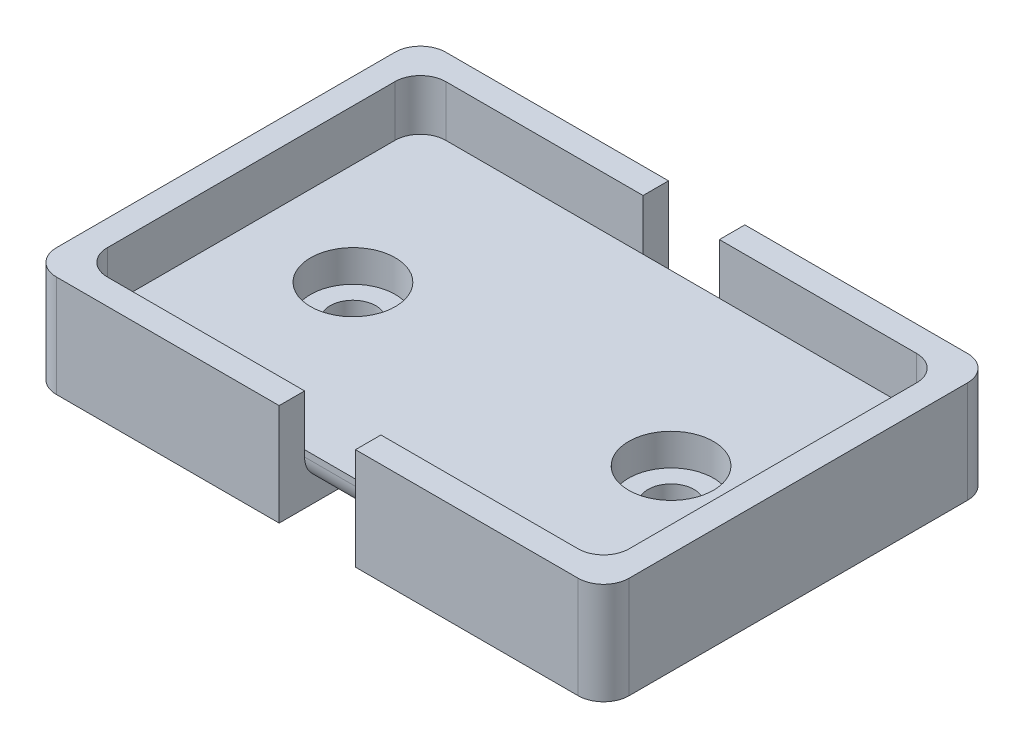
ISO-10303-21;
HEADER;
FILE_DESCRIPTION(('STEP AP214'),'2;1');
FILE_NAME('part.step','',(''),(''),'','','');
FILE_SCHEMA(('AUTOMOTIVE_DESIGN { 1 0 10303 214 1 1 1 1 }'));
ENDSEC;
DATA;
#1=APPLICATION_CONTEXT('core data for automotive mechanical design processes');
#2=APPLICATION_PROTOCOL_DEFINITION('international standard','automotive_design',2000,#1);
#3=PRODUCT_CONTEXT('',#1,'mechanical');
#4=PRODUCT('Part','Part','',(#3));
#5=PRODUCT_RELATED_PRODUCT_CATEGORY('part','',(#4));
#6=PRODUCT_DEFINITION_FORMATION('','',#4);
#7=PRODUCT_DEFINITION_CONTEXT('part definition',#1,'design');
#8=PRODUCT_DEFINITION('design','',#6,#7);
#9=PRODUCT_DEFINITION_SHAPE('','',#8);
#10=(LENGTH_UNIT() NAMED_UNIT(*) SI_UNIT(.MILLI.,.METRE.));
#11=(NAMED_UNIT(*) PLANE_ANGLE_UNIT() SI_UNIT($,.RADIAN.));
#12=(NAMED_UNIT(*) SI_UNIT($,.STERADIAN.) SOLID_ANGLE_UNIT());
#13=UNCERTAINTY_MEASURE_WITH_UNIT(LENGTH_MEASURE(1.E-05),#10,'distance_accuracy_value','');
#14=(GEOMETRIC_REPRESENTATION_CONTEXT(3) GLOBAL_UNCERTAINTY_ASSIGNED_CONTEXT((#13)) GLOBAL_UNIT_ASSIGNED_CONTEXT((#10,
#11,#12)) REPRESENTATION_CONTEXT('',''));
#15=CARTESIAN_POINT('',(0.,0.,0.));
#16=DIRECTION('',(0.,0.,1.));
#17=DIRECTION('',(1.,0.,0.));
#18=AXIS2_PLACEMENT_3D('',#15,#16,#17);
#19=CARTESIAN_POINT('',(0.,5.08,0.));
#20=DIRECTION('',(0.,1.,0.));
#21=DIRECTION('',(0.,0.,1.));
#22=AXIS2_PLACEMENT_3D('',#19,#20,#21);
#23=PLANE('',#22);
#24=CARTESIAN_POINT('',(41.91,5.08,-16.891));
#25=DIRECTION('',(0.,1.,0.));
#26=DIRECTION('',(0.,0.,1.));
#27=AXIS2_PLACEMENT_3D('',#24,#25,#26);
#28=CIRCLE('',#27,4.2291);
#29=CARTESIAN_POINT('',(41.91,5.08,-12.6619));
#30=VERTEX_POINT('',#29);
#31=EDGE_CURVE('E335',#30,#30,#28,.T.);
#32=ORIENTED_EDGE('',*,*,#31,.F.);
#33=EDGE_LOOP('',(#32));
#34=FACE_BOUND('',#33,.T.);
#35=CARTESIAN_POINT('',(10.16,5.08,-16.891));
#36=DIRECTION('',(0.,1.,0.));
#37=DIRECTION('',(0.,0.,1.));
#38=AXIS2_PLACEMENT_3D('',#35,#36,#37);
#39=CIRCLE('',#38,4.2291);
#40=CARTESIAN_POINT('',(10.16,5.08,-12.6619));
#41=VERTEX_POINT('',#40);
#42=EDGE_CURVE('E332',#41,#41,#39,.T.);
#43=ORIENTED_EDGE('',*,*,#42,.F.);
#44=EDGE_LOOP('',(#43));
#45=FACE_BOUND('',#44,.T.);
#46=DIRECTION('',(0.,0.,-1.));
#47=VECTOR('',#46,1.);
#48=CARTESIAN_POINT('',(0.,5.08,0.));
#49=LINE('',#48,#47);
#50=CARTESIAN_POINT('',(0.,5.08,-2.54));
#51=VERTEX_POINT('',#50);
#52=CARTESIAN_POINT('',(0.,5.08,-31.242));
#53=VERTEX_POINT('',#52);
#54=EDGE_CURVE('E301',#51,#53,#49,.T.);
#55=ORIENTED_EDGE('',*,*,#54,.F.);
#56=CARTESIAN_POINT('',(2.54,5.08,-2.54));
#57=DIRECTION('',(0.,1.,0.));
#58=DIRECTION('',(0.,0.,1.));
#59=AXIS2_PLACEMENT_3D('',#56,#57,#58);
#60=CIRCLE('',#59,2.54);
#61=CARTESIAN_POINT('',(2.54,5.08,0.));
#62=VERTEX_POINT('',#61);
#63=EDGE_CURVE('E424',#51,#62,#60,.T.);
#64=ORIENTED_EDGE('',*,*,#63,.T.);
#65=DIRECTION('',(1.,0.,0.));
#66=VECTOR('',#65,1.);
#67=CARTESIAN_POINT('',(0.,5.08,0.));
#68=LINE('',#67,#66);
#69=CARTESIAN_POINT('',(22.225,5.08,0.));
#70=VERTEX_POINT('',#69);
#71=EDGE_CURVE('E279',#62,#70,#68,.T.);
#72=ORIENTED_EDGE('',*,*,#71,.T.);
#73=DIRECTION('',(1.,0.,0.));
#74=VECTOR('',#73,1.);
#75=CARTESIAN_POINT('',(0.,5.08,0.));
#76=LINE('',#75,#74);
#77=CARTESIAN_POINT('',(29.845,5.08,0.));
#78=VERTEX_POINT('',#77);
#79=EDGE_CURVE('E326',#70,#78,#76,.T.);
#80=ORIENTED_EDGE('',*,*,#79,.T.);
#81=DIRECTION('',(1.,0.,0.));
#82=VECTOR('',#81,1.);
#83=CARTESIAN_POINT('',(0.,5.08,0.));
#84=LINE('',#83,#82);
#85=CARTESIAN_POINT('',(49.53,5.08,0.));
#86=VERTEX_POINT('',#85);
#87=EDGE_CURVE('E252',#78,#86,#84,.T.);
#88=ORIENTED_EDGE('',*,*,#87,.T.);
#89=CARTESIAN_POINT('',(49.53,5.08,-2.54));
#90=DIRECTION('',(0.,1.,0.));
#91=DIRECTION('',(0.,0.,1.));
#92=AXIS2_PLACEMENT_3D('',#89,#90,#91);
#93=CIRCLE('',#92,2.54);
#94=CARTESIAN_POINT('',(52.07,5.08,-2.54));
#95=VERTEX_POINT('',#94);
#96=EDGE_CURVE('E422',#86,#95,#93,.T.);
#97=ORIENTED_EDGE('',*,*,#96,.T.);
#98=DIRECTION('',(0.,0.,-1.));
#99=VECTOR('',#98,1.);
#100=CARTESIAN_POINT('',(52.07,5.08,0.));
#101=LINE('',#100,#99);
#102=CARTESIAN_POINT('',(52.07,5.08,-31.242));
#103=VERTEX_POINT('',#102);
#104=EDGE_CURVE('E255',#95,#103,#101,.T.);
#105=ORIENTED_EDGE('',*,*,#104,.T.);
#106=CARTESIAN_POINT('',(49.53,5.08,-31.242));
#107=DIRECTION('',(0.,1.,0.));
#108=DIRECTION('',(0.,0.,1.));
#109=AXIS2_PLACEMENT_3D('',#106,#107,#108);
#110=CIRCLE('',#109,2.54);
#111=CARTESIAN_POINT('',(49.53,5.08,-33.782));
#112=VERTEX_POINT('',#111);
#113=EDGE_CURVE('E420',#103,#112,#110,.T.);
#114=ORIENTED_EDGE('',*,*,#113,.T.);
#115=DIRECTION('',(1.,0.,0.));
#116=VECTOR('',#115,1.);
#117=CARTESIAN_POINT('',(0.,5.08,-33.782));
#118=LINE('',#117,#116);
#119=CARTESIAN_POINT('',(29.845,5.08,-33.782));
#120=VERTEX_POINT('',#119);
#121=EDGE_CURVE('E271',#120,#112,#118,.T.);
#122=ORIENTED_EDGE('',*,*,#121,.F.);
#123=DIRECTION('',(1.,0.,0.));
#124=VECTOR('',#123,1.);
#125=CARTESIAN_POINT('',(0.,5.08,-33.782));
#126=LINE('',#125,#124);
#127=CARTESIAN_POINT('',(22.225,5.08,-33.782));
#128=VERTEX_POINT('',#127);
#129=EDGE_CURVE('E328',#128,#120,#126,.T.);
#130=ORIENTED_EDGE('',*,*,#129,.F.);
#131=DIRECTION('',(1.,0.,0.));
#132=VECTOR('',#131,1.);
#133=CARTESIAN_POINT('',(0.,5.08,-33.782));
#134=LINE('',#133,#132);
#135=CARTESIAN_POINT('',(2.54,5.08,-33.782));
#136=VERTEX_POINT('',#135);
#137=EDGE_CURVE('E284',#136,#128,#134,.T.);
#138=ORIENTED_EDGE('',*,*,#137,.F.);
#139=CARTESIAN_POINT('',(2.54,5.08,-31.242));
#140=DIRECTION('',(0.,1.,0.));
#141=DIRECTION('',(0.,0.,1.));
#142=AXIS2_PLACEMENT_3D('',#139,#140,#141);
#143=CIRCLE('',#142,2.54);
#144=EDGE_CURVE('E418',#136,#53,#143,.T.);
#145=ORIENTED_EDGE('',*,*,#144,.T.);
#146=EDGE_LOOP('',(#55,#64,#72,#80,#88,#97,#105,#114,#122,#130,#138,#145));
#147=FACE_BOUND('',#146,.T.);
#148=ADVANCED_FACE('F35',(#34,#45,#147),#23,.T.);
#149=CARTESIAN_POINT('',(0.,1.905,0.));
#150=DIRECTION('',(0.,1.,0.));
#151=DIRECTION('',(0.,0.,1.));
#152=AXIS2_PLACEMENT_3D('',#149,#150,#151);
#153=PLANE('',#152);
#154=DIRECTION('',(0.,0.,1.));
#155=VECTOR('',#154,1.);
#156=CARTESIAN_POINT('',(22.225,1.905,0.));
#157=LINE('',#156,#155);
#158=CARTESIAN_POINT('',(22.225,1.905,-31.242));
#159=VERTEX_POINT('',#158);
#160=CARTESIAN_POINT('',(22.225,1.905,-2.54));
#161=VERTEX_POINT('',#160);
#162=EDGE_CURVE('E354',#159,#161,#157,.T.);
#163=ORIENTED_EDGE('',*,*,#162,.F.);
#164=DIRECTION('',(1.,0.,0.));
#165=VECTOR('',#164,1.);
#166=CARTESIAN_POINT('',(29.845,1.905,-31.242));
#167=LINE('',#166,#165);
#168=CARTESIAN_POINT('',(29.845,1.905,-31.242));
#169=VERTEX_POINT('',#168);
#170=EDGE_CURVE('E362',#159,#169,#167,.T.);
#171=ORIENTED_EDGE('',*,*,#170,.T.);
#172=DIRECTION('',(0.,0.,-1.));
#173=VECTOR('',#172,1.);
#174=CARTESIAN_POINT('',(29.845,1.905,0.));
#175=LINE('',#174,#173);
#176=CARTESIAN_POINT('',(29.845,1.905,-2.54));
#177=VERTEX_POINT('',#176);
#178=EDGE_CURVE('E374',#177,#169,#175,.T.);
#179=ORIENTED_EDGE('',*,*,#178,.F.);
#180=DIRECTION('',(1.,0.,0.));
#181=VECTOR('',#180,1.);
#182=CARTESIAN_POINT('',(0.,1.905,-2.54));
#183=LINE('',#182,#181);
#184=EDGE_CURVE('E360',#177,#161,#183,.F.);
#185=ORIENTED_EDGE('',*,*,#184,.T.);
#186=EDGE_LOOP('',(#163,#171,#179,#185));
#187=FACE_BOUND('',#186,.T.);
#188=ADVANCED_FACE('F378',(#187),#153,.F.);
#189=CARTESIAN_POINT('',(0.,1.905,0.));
#190=DIRECTION('',(0.,1.,0.));
#191=DIRECTION('',(0.,0.,1.));
#192=AXIS2_PLACEMENT_3D('',#189,#190,#191);
#193=PLANE('',#192);
#194=CARTESIAN_POINT('',(10.16,1.905,-16.891));
#195=DIRECTION('',(0.,1.,0.));
#196=DIRECTION('',(0.,0.,1.));
#197=AXIS2_PLACEMENT_3D('',#194,#195,#196);
#198=CIRCLE('',#197,2.286);
#199=CARTESIAN_POINT('',(10.16,1.905,-14.605));
#200=VERTEX_POINT('',#199);
#201=EDGE_CURVE('E351',#200,#200,#198,.T.);
#202=ORIENTED_EDGE('',*,*,#201,.F.);
#203=EDGE_LOOP('',(#202));
#204=FACE_BOUND('',#203,.T.);
#205=CARTESIAN_POINT('',(10.16,1.905,-16.891));
#206=DIRECTION('',(0.,1.,0.));
#207=DIRECTION('',(0.,0.,1.));
#208=AXIS2_PLACEMENT_3D('',#205,#206,#207);
#209=CIRCLE('',#208,4.2291);
#210=CARTESIAN_POINT('',(10.16,1.905,-12.6619));
#211=VERTEX_POINT('',#210);
#212=EDGE_CURVE('E313',#211,#211,#209,.T.);
#213=ORIENTED_EDGE('',*,*,#212,.T.);
#214=EDGE_LOOP('',(#213));
#215=FACE_BOUND('',#214,.T.);
#216=ADVANCED_FACE('F554',(#204,#215),#193,.T.);
#217=CARTESIAN_POINT('',(0.,1.905,2.54));
#218=DIRECTION('',(0.,0.,-1.));
#219=DIRECTION('',(-1.,0.,0.));
#220=AXIS2_PLACEMENT_3D('',#217,#218,#219);
#221=PLANE('',#220);
#222=DIRECTION('',(1.,0.,0.));
#223=VECTOR('',#222,1.);
#224=CARTESIAN_POINT('',(0.,10.16,2.54));
#225=LINE('',#224,#223);
#226=CARTESIAN_POINT('',(0.,10.16,2.54));
#227=VERTEX_POINT('',#226);
#228=CARTESIAN_POINT('',(22.225,10.16,2.54));
#229=VERTEX_POINT('',#228);
#230=EDGE_CURVE('E290',#227,#229,#225,.T.);
#231=ORIENTED_EDGE('',*,*,#230,.F.);
#232=DIRECTION('',(0.,-1.,0.));
#233=VECTOR('',#232,1.);
#234=CARTESIAN_POINT('',(0.,0.,2.54));
#235=LINE('',#234,#233);
#236=CARTESIAN_POINT('',(0.,0.,2.54));
#237=VERTEX_POINT('',#236);
#238=EDGE_CURVE('E428',#227,#237,#235,.T.);
#239=ORIENTED_EDGE('',*,*,#238,.T.);
#240=DIRECTION('',(1.,0.,0.));
#241=VECTOR('',#240,1.);
#242=CARTESIAN_POINT('',(0.,0.,2.54));
#243=LINE('',#242,#241);
#244=CARTESIAN_POINT('',(22.225,0.,2.54));
#245=VERTEX_POINT('',#244);
#246=EDGE_CURVE('E387',#237,#245,#243,.T.);
#247=ORIENTED_EDGE('',*,*,#246,.T.);
#248=DIRECTION('',(0.,-1.,0.));
#249=VECTOR('',#248,1.);
#250=CARTESIAN_POINT('',(22.225,1.905,2.54));
#251=LINE('',#250,#249);
#252=EDGE_CURVE('E381',#229,#245,#251,.T.);
#253=ORIENTED_EDGE('',*,*,#252,.F.);
#254=EDGE_LOOP('',(#231,#239,#247,#253));
#255=FACE_BOUND('',#254,.T.);
#256=ADVANCED_FACE('F506',(#255),#221,.F.);
#257=CARTESIAN_POINT('',(22.225,1.905,0.));
#258=DIRECTION('',(1.,0.,0.));
#259=DIRECTION('',(0.,0.,-1.));
#260=AXIS2_PLACEMENT_3D('',#257,#258,#259);
#261=PLANE('',#260);
#262=DIRECTION('',(0.,0.,1.));
#263=VECTOR('',#262,1.);
#264=CARTESIAN_POINT('',(22.225,0.,0.));
#265=LINE('',#264,#263);
#266=CARTESIAN_POINT('',(22.225,0.,-36.322));
#267=VERTEX_POINT('',#266);
#268=EDGE_CURVE('E389',#267,#245,#265,.T.);
#269=ORIENTED_EDGE('',*,*,#268,.F.);
#270=DIRECTION('',(0.,-1.,0.));
#271=VECTOR('',#270,1.);
#272=CARTESIAN_POINT('',(22.225,1.905,-36.322));
#273=LINE('',#272,#271);
#274=CARTESIAN_POINT('',(22.225,10.16,-36.322));
#275=VERTEX_POINT('',#274);
#276=EDGE_CURVE('E509',#275,#267,#273,.T.);
#277=ORIENTED_EDGE('',*,*,#276,.F.);
#278=DIRECTION('',(0.,0.,1.));
#279=VECTOR('',#278,1.);
#280=CARTESIAN_POINT('',(22.225,10.16,0.));
#281=LINE('',#280,#279);
#282=CARTESIAN_POINT('',(22.225,10.16,-33.782));
#283=VERTEX_POINT('',#282);
#284=EDGE_CURVE('E280',#275,#283,#281,.T.);
#285=ORIENTED_EDGE('',*,*,#284,.T.);
#286=DIRECTION('',(0.,-1.,0.));
#287=VECTOR('',#286,1.);
#288=CARTESIAN_POINT('',(22.225,10.16,-33.782));
#289=LINE('',#288,#287);
#290=EDGE_CURVE('E299',#283,#128,#289,.T.);
#291=ORIENTED_EDGE('',*,*,#290,.T.);
#292=DIRECTION('',(0.,-1.,0.));
#293=VECTOR('',#292,1.);
#294=CARTESIAN_POINT('',(22.225,5.08,-33.782));
#295=LINE('',#294,#293);
#296=CARTESIAN_POINT('',(22.225,4.445,-33.782));
#297=VERTEX_POINT('',#296);
#298=EDGE_CURVE('E338',#128,#297,#295,.T.);
#299=ORIENTED_EDGE('',*,*,#298,.T.);
#300=CARTESIAN_POINT('',(22.225,4.445,-31.242));
#301=DIRECTION('',(1.,0.,0.));
#302=DIRECTION('',(0.,0.,-1.));
#303=AXIS2_PLACEMENT_3D('',#300,#301,#302);
#304=CIRCLE('',#303,2.54);
#305=EDGE_CURVE('E371',#297,#159,#304,.F.);
#306=ORIENTED_EDGE('',*,*,#305,.T.);
#307=ORIENTED_EDGE('',*,*,#162,.T.);
#308=CARTESIAN_POINT('',(22.225,4.445,-2.54));
#309=DIRECTION('',(1.,0.,0.));
#310=DIRECTION('',(0.,0.,-1.));
#311=AXIS2_PLACEMENT_3D('',#308,#309,#310);
#312=CIRCLE('',#311,2.54);
#313=CARTESIAN_POINT('',(22.225,4.445,0.));
#314=VERTEX_POINT('',#313);
#315=EDGE_CURVE('E11',#161,#314,#312,.F.);
#316=ORIENTED_EDGE('',*,*,#315,.T.);
#317=DIRECTION('',(0.,-1.,0.));
#318=VECTOR('',#317,1.);
#319=CARTESIAN_POINT('',(22.225,5.08,0.));
#320=LINE('',#319,#318);
#321=EDGE_CURVE('E348',#70,#314,#320,.T.);
#322=ORIENTED_EDGE('',*,*,#321,.F.);
#323=DIRECTION('',(0.,-1.,0.));
#324=VECTOR('',#323,1.);
#325=CARTESIAN_POINT('',(22.225,10.16,0.));
#326=LINE('',#325,#324);
#327=CARTESIAN_POINT('',(22.225,10.16,0.));
#328=VERTEX_POINT('',#327);
#329=EDGE_CURVE('E307',#328,#70,#326,.T.);
#330=ORIENTED_EDGE('',*,*,#329,.F.);
#331=EDGE_CURVE('E285',#328,#229,#281,.T.);
#332=ORIENTED_EDGE('',*,*,#331,.T.);
#333=ORIENTED_EDGE('',*,*,#252,.T.);
#334=EDGE_LOOP('',(#269,#277,#285,#291,#299,#306,#307,#316,#322,#330,#332,#333));
#335=FACE_BOUND('',#334,.T.);
#336=ADVANCED_FACE('F498',(#335),#261,.T.);
#337=CARTESIAN_POINT('',(0.,1.905,-36.322));
#338=DIRECTION('',(0.,0.,-1.));
#339=DIRECTION('',(-1.,0.,0.));
#340=AXIS2_PLACEMENT_3D('',#337,#338,#339);
#341=PLANE('',#340);
#342=DIRECTION('',(1.,0.,0.));
#343=VECTOR('',#342,1.);
#344=CARTESIAN_POINT('',(0.,0.,-36.322));
#345=LINE('',#344,#343);
#346=CARTESIAN_POINT('',(0.,0.,-36.322));
#347=VERTEX_POINT('',#346);
#348=EDGE_CURVE('E521',#347,#267,#345,.T.);
#349=ORIENTED_EDGE('',*,*,#348,.F.);
#350=DIRECTION('',(0.,-1.,0.));
#351=VECTOR('',#350,1.);
#352=CARTESIAN_POINT('',(0.,1.905,-36.322));
#353=LINE('',#352,#351);
#354=CARTESIAN_POINT('',(0.,10.16,-36.322));
#355=VERTEX_POINT('',#354);
#356=EDGE_CURVE('E407',#347,#355,#353,.F.);
#357=ORIENTED_EDGE('',*,*,#356,.T.);
#358=DIRECTION('',(1.,0.,0.));
#359=VECTOR('',#358,1.);
#360=CARTESIAN_POINT('',(0.,10.16,-36.322));
#361=LINE('',#360,#359);
#362=EDGE_CURVE('E283',#355,#275,#361,.T.);
#363=ORIENTED_EDGE('',*,*,#362,.T.);
#364=ORIENTED_EDGE('',*,*,#276,.T.);
#365=EDGE_LOOP('',(#349,#357,#363,#364));
#366=FACE_BOUND('',#365,.T.);
#367=ADVANCED_FACE('F599',(#366),#341,.T.);
#368=CARTESIAN_POINT('',(-2.54,1.905,0.));
#369=DIRECTION('',(-1.,0.,0.));
#370=DIRECTION('',(0.,0.,1.));
#371=AXIS2_PLACEMENT_3D('',#368,#369,#370);
#372=PLANE('',#371);
#373=DIRECTION('',(0.,0.,-1.));
#374=VECTOR('',#373,1.);
#375=CARTESIAN_POINT('',(-2.54,10.16,0.));
#376=LINE('',#375,#374);
#377=CARTESIAN_POINT('',(-2.54,10.16,0.));
#378=VERTEX_POINT('',#377);
#379=CARTESIAN_POINT('',(-2.54,10.16,-33.782));
#380=VERTEX_POINT('',#379);
#381=EDGE_CURVE('E287',#378,#380,#376,.T.);
#382=ORIENTED_EDGE('',*,*,#381,.T.);
#383=DIRECTION('',(0.,-1.,0.));
#384=VECTOR('',#383,1.);
#385=CARTESIAN_POINT('',(-2.54,1.905,-33.782));
#386=LINE('',#385,#384);
#387=CARTESIAN_POINT('',(-2.54,0.,-33.782));
#388=VERTEX_POINT('',#387);
#389=EDGE_CURVE('E400',#380,#388,#386,.T.);
#390=ORIENTED_EDGE('',*,*,#389,.T.);
#391=DIRECTION('',(0.,0.,-1.));
#392=VECTOR('',#391,1.);
#393=CARTESIAN_POINT('',(-2.54,0.,0.));
#394=LINE('',#393,#392);
#395=CARTESIAN_POINT('',(-2.54,0.,0.));
#396=VERTEX_POINT('',#395);
#397=EDGE_CURVE('E518',#396,#388,#394,.T.);
#398=ORIENTED_EDGE('',*,*,#397,.F.);
#399=DIRECTION('',(0.,-1.,0.));
#400=VECTOR('',#399,1.);
#401=CARTESIAN_POINT('',(-2.54,10.16,0.));
#402=LINE('',#401,#400);
#403=EDGE_CURVE('E380',#396,#378,#402,.F.);
#404=ORIENTED_EDGE('',*,*,#403,.T.);
#405=EDGE_LOOP('',(#382,#390,#398,#404));
#406=FACE_BOUND('',#405,.T.);
#407=ADVANCED_FACE('F533',(#406),#372,.T.);
#408=CARTESIAN_POINT('',(10.16,1.905,-16.891));
#409=DIRECTION('',(0.,-1.,0.));
#410=DIRECTION('',(0.,0.,-1.));
#411=AXIS2_PLACEMENT_3D('',#408,#409,#410);
#412=CYLINDRICAL_SURFACE('',#411,2.286);
#413=ORIENTED_EDGE('',*,*,#201,.T.);
#414=EDGE_LOOP('',(#413));
#415=FACE_BOUND('',#414,.T.);
#416=CARTESIAN_POINT('',(10.16,0.,-16.891));
#417=DIRECTION('',(0.,1.,0.));
#418=DIRECTION('',(0.,0.,1.));
#419=AXIS2_PLACEMENT_3D('',#416,#417,#418);
#420=CIRCLE('',#419,2.286);
#421=CARTESIAN_POINT('',(10.16,0.,-14.605));
#422=VERTEX_POINT('',#421);
#423=EDGE_CURVE('E357',#422,#422,#420,.T.);
#424=ORIENTED_EDGE('',*,*,#423,.F.);
#425=EDGE_LOOP('',(#424));
#426=FACE_BOUND('',#425,.T.);
#427=ADVANCED_FACE('F593',(#415,#426),#412,.F.);
#428=CARTESIAN_POINT('',(0.,0.,0.));
#429=DIRECTION('',(0.,1.,0.));
#430=DIRECTION('',(0.,0.,1.));
#431=AXIS2_PLACEMENT_3D('',#428,#429,#430);
#432=PLANE('',#431);
#433=ORIENTED_EDGE('',*,*,#397,.T.);
#434=CARTESIAN_POINT('',(0.,0.,-33.782));
#435=DIRECTION('',(0.,1.,0.));
#436=DIRECTION('',(0.,0.,1.));
#437=AXIS2_PLACEMENT_3D('',#434,#435,#436);
#438=CIRCLE('',#437,2.54);
#439=EDGE_CURVE('E405',#388,#347,#438,.F.);
#440=ORIENTED_EDGE('',*,*,#439,.T.);
#441=ORIENTED_EDGE('',*,*,#348,.T.);
#442=ORIENTED_EDGE('',*,*,#268,.T.);
#443=ORIENTED_EDGE('',*,*,#246,.F.);
#444=CARTESIAN_POINT('',(0.,0.,0.));
#445=DIRECTION('',(0.,1.,0.));
#446=DIRECTION('',(0.,0.,1.));
#447=AXIS2_PLACEMENT_3D('',#444,#445,#446);
#448=CIRCLE('',#447,2.54);
#449=EDGE_CURVE('E403',#237,#396,#448,.F.);
#450=ORIENTED_EDGE('',*,*,#449,.T.);
#451=EDGE_LOOP('',(#433,#440,#441,#442,#443,#450));
#452=FACE_BOUND('',#451,.T.);
#453=ORIENTED_EDGE('',*,*,#423,.T.);
#454=EDGE_LOOP('',(#453));
#455=FACE_BOUND('',#454,.T.);
#456=ADVANCED_FACE('F524',(#452,#455),#432,.F.);
#457=CARTESIAN_POINT('',(0.,5.08,0.));
#458=DIRECTION('',(0.,0.,-1.));
#459=DIRECTION('',(-1.,0.,0.));
#460=AXIS2_PLACEMENT_3D('',#457,#458,#459);
#461=PLANE('',#460);
#462=ORIENTED_EDGE('',*,*,#321,.T.);
#463=DIRECTION('',(1.,0.,0.));
#464=VECTOR('',#463,1.);
#465=CARTESIAN_POINT('',(0.,4.445,0.));
#466=LINE('',#465,#464);
#467=CARTESIAN_POINT('',(29.845,4.445,0.));
#468=VERTEX_POINT('',#467);
#469=EDGE_CURVE('E367',#314,#468,#466,.T.);
#470=ORIENTED_EDGE('',*,*,#469,.T.);
#471=DIRECTION('',(0.,-1.,0.));
#472=VECTOR('',#471,1.);
#473=CARTESIAN_POINT('',(29.845,5.08,0.));
#474=LINE('',#473,#472);
#475=EDGE_CURVE('E346',#78,#468,#474,.T.);
#476=ORIENTED_EDGE('',*,*,#475,.F.);
#477=ORIENTED_EDGE('',*,*,#79,.F.);
#478=EDGE_LOOP('',(#462,#470,#476,#477));
#479=FACE_BOUND('',#478,.T.);
#480=ADVANCED_FACE('F384',(#479),#461,.F.);
#481=CARTESIAN_POINT('',(29.845,5.08,0.));
#482=DIRECTION('',(1.,0.,0.));
#483=DIRECTION('',(0.,0.,-1.));
#484=AXIS2_PLACEMENT_3D('',#481,#482,#483);
#485=PLANE('',#484);
#486=ORIENTED_EDGE('',*,*,#475,.T.);
#487=CARTESIAN_POINT('',(29.845,4.445,-2.54));
#488=DIRECTION('',(1.,0.,0.));
#489=DIRECTION('',(0.,0.,-1.));
#490=AXIS2_PLACEMENT_3D('',#487,#488,#489);
#491=CIRCLE('',#490,2.54);
#492=EDGE_CURVE('E43',#468,#177,#491,.T.);
#493=ORIENTED_EDGE('',*,*,#492,.T.);
#494=ORIENTED_EDGE('',*,*,#178,.T.);
#495=CARTESIAN_POINT('',(29.845,4.445,-31.242));
#496=DIRECTION('',(1.,0.,0.));
#497=DIRECTION('',(0.,0.,-1.));
#498=AXIS2_PLACEMENT_3D('',#495,#496,#497);
#499=CIRCLE('',#498,2.54);
#500=CARTESIAN_POINT('',(29.845,4.445,-33.782));
#501=VERTEX_POINT('',#500);
#502=EDGE_CURVE('E369',#169,#501,#499,.T.);
#503=ORIENTED_EDGE('',*,*,#502,.T.);
#504=DIRECTION('',(0.,-1.,0.));
#505=VECTOR('',#504,1.);
#506=CARTESIAN_POINT('',(29.845,5.08,-33.782));
#507=LINE('',#506,#505);
#508=EDGE_CURVE('E233',#120,#501,#507,.T.);
#509=ORIENTED_EDGE('',*,*,#508,.F.);
#510=DIRECTION('',(0.,-1.,0.));
#511=VECTOR('',#510,1.);
#512=CARTESIAN_POINT('',(29.845,10.16,-33.782));
#513=LINE('',#512,#511);
#514=CARTESIAN_POINT('',(29.845,10.16,-33.782));
#515=VERTEX_POINT('',#514);
#516=EDGE_CURVE('E241',#515,#120,#513,.T.);
#517=ORIENTED_EDGE('',*,*,#516,.F.);
#518=DIRECTION('',(0.,0.,1.));
#519=VECTOR('',#518,1.);
#520=CARTESIAN_POINT('',(29.845,10.16,0.));
#521=LINE('',#520,#519);
#522=CARTESIAN_POINT('',(29.845,10.16,-36.322));
#523=VERTEX_POINT('',#522);
#524=EDGE_CURVE('E236',#523,#515,#521,.T.);
#525=ORIENTED_EDGE('',*,*,#524,.F.);
#526=DIRECTION('',(0.,-1.,0.));
#527=VECTOR('',#526,1.);
#528=CARTESIAN_POINT('',(29.845,5.08,-36.322));
#529=LINE('',#528,#527);
#530=CARTESIAN_POINT('',(29.845,0.,-36.322));
#531=VERTEX_POINT('',#530);
#532=EDGE_CURVE('E220',#523,#531,#529,.T.);
#533=ORIENTED_EDGE('',*,*,#532,.T.);
#534=DIRECTION('',(0.,0.,1.));
#535=VECTOR('',#534,1.);
#536=CARTESIAN_POINT('',(29.845,0.,0.));
#537=LINE('',#536,#535);
#538=CARTESIAN_POINT('',(29.845,0.,2.54));
#539=VERTEX_POINT('',#538);
#540=EDGE_CURVE('E316',#531,#539,#537,.T.);
#541=ORIENTED_EDGE('',*,*,#540,.T.);
#542=DIRECTION('',(0.,-1.,0.));
#543=VECTOR('',#542,1.);
#544=CARTESIAN_POINT('',(29.845,5.08,2.54));
#545=LINE('',#544,#543);
#546=CARTESIAN_POINT('',(29.845,10.16,2.54));
#547=VERTEX_POINT('',#546);
#548=EDGE_CURVE('E232',#547,#539,#545,.T.);
#549=ORIENTED_EDGE('',*,*,#548,.F.);
#550=CARTESIAN_POINT('',(29.845,10.16,0.));
#551=VERTEX_POINT('',#550);
#552=EDGE_CURVE('E247',#551,#547,#521,.T.);
#553=ORIENTED_EDGE('',*,*,#552,.F.);
#554=DIRECTION('',(0.,-1.,0.));
#555=VECTOR('',#554,1.);
#556=CARTESIAN_POINT('',(29.845,10.16,0.));
#557=LINE('',#556,#555);
#558=EDGE_CURVE('E270',#551,#78,#557,.T.);
#559=ORIENTED_EDGE('',*,*,#558,.T.);
#560=EDGE_LOOP('',(#486,#493,#494,#503,#509,#517,#525,#533,#541,#549,#553,#559));
#561=FACE_BOUND('',#560,.T.);
#562=ADVANCED_FACE('F238',(#561),#485,.F.);
#563=CARTESIAN_POINT('',(0.,5.08,2.54));
#564=DIRECTION('',(0.,0.,-1.));
#565=DIRECTION('',(-1.,0.,0.));
#566=AXIS2_PLACEMENT_3D('',#563,#564,#565);
#567=PLANE('',#566);
#568=DIRECTION('',(1.,0.,0.));
#569=VECTOR('',#568,1.);
#570=CARTESIAN_POINT('',(0.,0.,2.54));
#571=LINE('',#570,#569);
#572=CARTESIAN_POINT('',(52.07,0.,2.54));
#573=VERTEX_POINT('',#572);
#574=EDGE_CURVE('E318',#539,#573,#571,.T.);
#575=ORIENTED_EDGE('',*,*,#574,.T.);
#576=DIRECTION('',(0.,-1.,0.));
#577=VECTOR('',#576,1.);
#578=CARTESIAN_POINT('',(52.07,5.08,2.54));
#579=LINE('',#578,#577);
#580=CARTESIAN_POINT('',(52.07,10.16,2.54));
#581=VERTEX_POINT('',#580);
#582=EDGE_CURVE('E445',#573,#581,#579,.F.);
#583=ORIENTED_EDGE('',*,*,#582,.T.);
#584=DIRECTION('',(1.,0.,0.));
#585=VECTOR('',#584,1.);
#586=CARTESIAN_POINT('',(0.,10.16,2.54));
#587=LINE('',#586,#585);
#588=EDGE_CURVE('E265',#547,#581,#587,.T.);
#589=ORIENTED_EDGE('',*,*,#588,.F.);
#590=ORIENTED_EDGE('',*,*,#548,.T.);
#591=EDGE_LOOP('',(#575,#583,#589,#590));
#592=FACE_BOUND('',#591,.T.);
#593=ADVANCED_FACE('F576',(#592),#567,.F.);
#594=CARTESIAN_POINT('',(54.61,5.08,0.));
#595=DIRECTION('',(-1.,0.,0.));
#596=DIRECTION('',(0.,0.,1.));
#597=AXIS2_PLACEMENT_3D('',#594,#595,#596);
#598=PLANE('',#597);
#599=DIRECTION('',(0.,0.,-1.));
#600=VECTOR('',#599,1.);
#601=CARTESIAN_POINT('',(54.61,0.,0.));
#602=LINE('',#601,#600);
#603=CARTESIAN_POINT('',(54.61,0.,0.));
#604=VERTEX_POINT('',#603);
#605=CARTESIAN_POINT('',(54.61,0.,-33.782));
#606=VERTEX_POINT('',#605);
#607=EDGE_CURVE('E321',#604,#606,#602,.T.);
#608=ORIENTED_EDGE('',*,*,#607,.T.);
#609=DIRECTION('',(0.,-1.,0.));
#610=VECTOR('',#609,1.);
#611=CARTESIAN_POINT('',(54.61,10.16,-33.782));
#612=LINE('',#611,#610);
#613=CARTESIAN_POINT('',(54.61,10.16,-33.782));
#614=VERTEX_POINT('',#613);
#615=EDGE_CURVE('E440',#606,#614,#612,.F.);
#616=ORIENTED_EDGE('',*,*,#615,.T.);
#617=DIRECTION('',(0.,0.,-1.));
#618=VECTOR('',#617,1.);
#619=CARTESIAN_POINT('',(54.61,10.16,0.));
#620=LINE('',#619,#618);
#621=CARTESIAN_POINT('',(54.61,10.16,0.));
#622=VERTEX_POINT('',#621);
#623=EDGE_CURVE('E268',#622,#614,#620,.T.);
#624=ORIENTED_EDGE('',*,*,#623,.F.);
#625=DIRECTION('',(0.,-1.,0.));
#626=VECTOR('',#625,1.);
#627=CARTESIAN_POINT('',(54.61,5.08,0.));
#628=LINE('',#627,#626);
#629=EDGE_CURVE('E437',#622,#604,#628,.T.);
#630=ORIENTED_EDGE('',*,*,#629,.T.);
#631=EDGE_LOOP('',(#608,#616,#624,#630));
#632=FACE_BOUND('',#631,.T.);
#633=ADVANCED_FACE('F579',(#632),#598,.F.);
#634=CARTESIAN_POINT('',(0.,5.08,-36.322));
#635=DIRECTION('',(0.,0.,-1.));
#636=DIRECTION('',(-1.,0.,0.));
#637=AXIS2_PLACEMENT_3D('',#634,#635,#636);
#638=PLANE('',#637);
#639=DIRECTION('',(1.,0.,0.));
#640=VECTOR('',#639,1.);
#641=CARTESIAN_POINT('',(0.,10.16,-36.322));
#642=LINE('',#641,#640);
#643=CARTESIAN_POINT('',(52.07,10.16,-36.322));
#644=VERTEX_POINT('',#643);
#645=EDGE_CURVE('E225',#523,#644,#642,.T.);
#646=ORIENTED_EDGE('',*,*,#645,.T.);
#647=DIRECTION('',(0.,-1.,0.));
#648=VECTOR('',#647,1.);
#649=CARTESIAN_POINT('',(52.07,0.,-36.322));
#650=LINE('',#649,#648);
#651=CARTESIAN_POINT('',(52.07,0.,-36.322));
#652=VERTEX_POINT('',#651);
#653=EDGE_CURVE('E431',#644,#652,#650,.T.);
#654=ORIENTED_EDGE('',*,*,#653,.T.);
#655=DIRECTION('',(1.,0.,0.));
#656=VECTOR('',#655,1.);
#657=CARTESIAN_POINT('',(0.,0.,-36.322));
#658=LINE('',#657,#656);
#659=EDGE_CURVE('E228',#531,#652,#658,.T.);
#660=ORIENTED_EDGE('',*,*,#659,.F.);
#661=ORIENTED_EDGE('',*,*,#532,.F.);
#662=EDGE_LOOP('',(#646,#654,#660,#661));
#663=FACE_BOUND('',#662,.T.);
#664=ADVANCED_FACE('F222',(#663),#638,.T.);
#665=CARTESIAN_POINT('',(0.,5.08,-33.782));
#666=DIRECTION('',(0.,0.,-1.));
#667=DIRECTION('',(-1.,0.,0.));
#668=AXIS2_PLACEMENT_3D('',#665,#666,#667);
#669=PLANE('',#668);
#670=ORIENTED_EDGE('',*,*,#508,.T.);
#671=DIRECTION('',(1.,0.,0.));
#672=VECTOR('',#671,1.);
#673=CARTESIAN_POINT('',(22.225,4.445,-33.782));
#674=LINE('',#673,#672);
#675=EDGE_CURVE('E365',#501,#297,#674,.F.);
#676=ORIENTED_EDGE('',*,*,#675,.T.);
#677=ORIENTED_EDGE('',*,*,#298,.F.);
#678=ORIENTED_EDGE('',*,*,#129,.T.);
#679=EDGE_LOOP('',(#670,#676,#677,#678));
#680=FACE_BOUND('',#679,.T.);
#681=ADVANCED_FACE('F569',(#680),#669,.T.);
#682=CARTESIAN_POINT('',(10.16,5.08,-16.891));
#683=DIRECTION('',(0.,-1.,0.));
#684=DIRECTION('',(0.,0.,-1.));
#685=AXIS2_PLACEMENT_3D('',#682,#683,#684);
#686=CYLINDRICAL_SURFACE('',#685,4.2291);
#687=ORIENTED_EDGE('',*,*,#42,.T.);
#688=EDGE_LOOP('',(#687));
#689=FACE_BOUND('',#688,.T.);
#690=ORIENTED_EDGE('',*,*,#212,.F.);
#691=EDGE_LOOP('',(#690));
#692=FACE_BOUND('',#691,.T.);
#693=ADVANCED_FACE('F565',(#689,#692),#686,.F.);
#694=CARTESIAN_POINT('',(41.91,5.08,-16.891));
#695=DIRECTION('',(0.,-1.,0.));
#696=DIRECTION('',(0.,0.,-1.));
#697=AXIS2_PLACEMENT_3D('',#694,#695,#696);
#698=CYLINDRICAL_SURFACE('',#697,4.2291);
#699=ORIENTED_EDGE('',*,*,#31,.T.);
#700=EDGE_LOOP('',(#699));
#701=FACE_BOUND('',#700,.T.);
#702=CARTESIAN_POINT('',(41.91,1.905,-16.891));
#703=DIRECTION('',(0.,1.,0.));
#704=DIRECTION('',(0.,0.,1.));
#705=AXIS2_PLACEMENT_3D('',#702,#703,#704);
#706=CIRCLE('',#705,4.2291);
#707=CARTESIAN_POINT('',(41.91,1.905,-12.6619));
#708=VERTEX_POINT('',#707);
#709=EDGE_CURVE('E329',#708,#708,#706,.T.);
#710=ORIENTED_EDGE('',*,*,#709,.F.);
#711=EDGE_LOOP('',(#710));
#712=FACE_BOUND('',#711,.T.);
#713=ADVANCED_FACE('F562',(#701,#712),#698,.F.);
#714=CARTESIAN_POINT('',(41.91,1.905,-16.891));
#715=DIRECTION('',(0.,-1.,0.));
#716=DIRECTION('',(0.,0.,-1.));
#717=AXIS2_PLACEMENT_3D('',#714,#715,#716);
#718=CYLINDRICAL_SURFACE('',#717,2.28599999999999);
#719=CARTESIAN_POINT('',(41.91,1.905,-16.891));
#720=DIRECTION('',(0.,1.,0.));
#721=DIRECTION('',(0.,0.,1.));
#722=AXIS2_PLACEMENT_3D('',#719,#720,#721);
#723=CIRCLE('',#722,2.28599999999999);
#724=CARTESIAN_POINT('',(41.91,1.905,-14.605));
#725=VERTEX_POINT('',#724);
#726=EDGE_CURVE('E310',#725,#725,#723,.T.);
#727=ORIENTED_EDGE('',*,*,#726,.T.);
#728=EDGE_LOOP('',(#727));
#729=FACE_BOUND('',#728,.T.);
#730=CARTESIAN_POINT('',(41.91,0.,-16.891));
#731=DIRECTION('',(0.,1.,0.));
#732=DIRECTION('',(0.,0.,1.));
#733=AXIS2_PLACEMENT_3D('',#730,#731,#732);
#734=CIRCLE('',#733,2.28599999999999);
#735=CARTESIAN_POINT('',(41.91,0.,-14.605));
#736=VERTEX_POINT('',#735);
#737=EDGE_CURVE('E314',#736,#736,#734,.T.);
#738=ORIENTED_EDGE('',*,*,#737,.F.);
#739=EDGE_LOOP('',(#738));
#740=FACE_BOUND('',#739,.T.);
#741=ADVANCED_FACE('F559',(#729,#740),#718,.F.);
#742=CARTESIAN_POINT('',(0.,1.905,0.));
#743=DIRECTION('',(0.,1.,0.));
#744=DIRECTION('',(0.,0.,1.));
#745=AXIS2_PLACEMENT_3D('',#742,#743,#744);
#746=PLANE('',#745);
#747=ORIENTED_EDGE('',*,*,#709,.T.);
#748=EDGE_LOOP('',(#747));
#749=FACE_BOUND('',#748,.T.);
#750=ORIENTED_EDGE('',*,*,#726,.F.);
#751=EDGE_LOOP('',(#750));
#752=FACE_BOUND('',#751,.T.);
#753=ADVANCED_FACE('F635',(#749,#752),#746,.T.);
#754=CARTESIAN_POINT('',(0.,0.,0.));
#755=DIRECTION('',(0.,1.,0.));
#756=DIRECTION('',(0.,0.,1.));
#757=AXIS2_PLACEMENT_3D('',#754,#755,#756);
#758=PLANE('',#757);
#759=ORIENTED_EDGE('',*,*,#659,.T.);
#760=CARTESIAN_POINT('',(52.07,0.,-33.782));
#761=DIRECTION('',(0.,1.,0.));
#762=DIRECTION('',(0.,0.,1.));
#763=AXIS2_PLACEMENT_3D('',#760,#761,#762);
#764=CIRCLE('',#763,2.54);
#765=EDGE_CURVE('E435',#652,#606,#764,.F.);
#766=ORIENTED_EDGE('',*,*,#765,.T.);
#767=ORIENTED_EDGE('',*,*,#607,.F.);
#768=CARTESIAN_POINT('',(52.07,0.,0.));
#769=DIRECTION('',(0.,1.,0.));
#770=DIRECTION('',(0.,0.,1.));
#771=AXIS2_PLACEMENT_3D('',#768,#769,#770);
#772=CIRCLE('',#771,2.54);
#773=EDGE_CURVE('E433',#604,#573,#772,.F.);
#774=ORIENTED_EDGE('',*,*,#773,.T.);
#775=ORIENTED_EDGE('',*,*,#574,.F.);
#776=ORIENTED_EDGE('',*,*,#540,.F.);
#777=EDGE_LOOP('',(#759,#766,#767,#774,#775,#776));
#778=FACE_BOUND('',#777,.T.);
#779=ORIENTED_EDGE('',*,*,#737,.T.);
#780=EDGE_LOOP('',(#779));
#781=FACE_BOUND('',#780,.T.);
#782=ADVANCED_FACE('F634',(#778,#781),#758,.F.);
#783=CARTESIAN_POINT('',(0.,10.16,0.));
#784=DIRECTION('',(0.,0.,-1.));
#785=DIRECTION('',(-1.,0.,0.));
#786=AXIS2_PLACEMENT_3D('',#783,#784,#785);
#787=PLANE('',#786);
#788=ORIENTED_EDGE('',*,*,#71,.F.);
#789=DIRECTION('',(0.,-1.,0.));
#790=VECTOR('',#789,1.);
#791=CARTESIAN_POINT('',(2.54,10.16,0.));
#792=LINE('',#791,#790);
#793=CARTESIAN_POINT('',(2.54,10.16,0.));
#794=VERTEX_POINT('',#793);
#795=EDGE_CURVE('E426',#62,#794,#792,.F.);
#796=ORIENTED_EDGE('',*,*,#795,.T.);
#797=DIRECTION('',(1.,0.,0.));
#798=VECTOR('',#797,1.);
#799=CARTESIAN_POINT('',(0.,10.16,0.));
#800=LINE('',#799,#798);
#801=EDGE_CURVE('E292',#794,#328,#800,.T.);
#802=ORIENTED_EDGE('',*,*,#801,.T.);
#803=ORIENTED_EDGE('',*,*,#329,.T.);
#804=EDGE_LOOP('',(#788,#796,#802,#803));
#805=FACE_BOUND('',#804,.T.);
#806=ADVANCED_FACE('F493',(#805),#787,.T.);
#807=CARTESIAN_POINT('',(0.,10.16,0.));
#808=DIRECTION('',(-1.,0.,0.));
#809=DIRECTION('',(0.,0.,1.));
#810=AXIS2_PLACEMENT_3D('',#807,#808,#809);
#811=PLANE('',#810);
#812=DIRECTION('',(0.,0.,-1.));
#813=VECTOR('',#812,1.);
#814=CARTESIAN_POINT('',(0.,10.16,0.));
#815=LINE('',#814,#813);
#816=CARTESIAN_POINT('',(0.,10.16,-2.54));
#817=VERTEX_POINT('',#816);
#818=CARTESIAN_POINT('',(0.,10.16,-31.242));
#819=VERTEX_POINT('',#818);
#820=EDGE_CURVE('E294',#817,#819,#815,.T.);
#821=ORIENTED_EDGE('',*,*,#820,.F.);
#822=DIRECTION('',(0.,-1.,0.));
#823=VECTOR('',#822,1.);
#824=CARTESIAN_POINT('',(0.,10.16,-2.54));
#825=LINE('',#824,#823);
#826=EDGE_CURVE('E415',#817,#51,#825,.T.);
#827=ORIENTED_EDGE('',*,*,#826,.T.);
#828=ORIENTED_EDGE('',*,*,#54,.T.);
#829=DIRECTION('',(0.,-1.,0.));
#830=VECTOR('',#829,1.);
#831=CARTESIAN_POINT('',(0.,10.16,-31.242));
#832=LINE('',#831,#830);
#833=EDGE_CURVE('E413',#53,#819,#832,.F.);
#834=ORIENTED_EDGE('',*,*,#833,.T.);
#835=EDGE_LOOP('',(#821,#827,#828,#834));
#836=FACE_BOUND('',#835,.T.);
#837=ADVANCED_FACE('F485',(#836),#811,.F.);
#838=CARTESIAN_POINT('',(0.,10.16,-33.782));
#839=DIRECTION('',(0.,0.,-1.));
#840=DIRECTION('',(-1.,0.,0.));
#841=AXIS2_PLACEMENT_3D('',#838,#839,#840);
#842=PLANE('',#841);
#843=DIRECTION('',(1.,0.,0.));
#844=VECTOR('',#843,1.);
#845=CARTESIAN_POINT('',(0.,10.16,-33.782));
#846=LINE('',#845,#844);
#847=CARTESIAN_POINT('',(2.54,10.16,-33.782));
#848=VERTEX_POINT('',#847);
#849=EDGE_CURVE('E297',#848,#283,#846,.T.);
#850=ORIENTED_EDGE('',*,*,#849,.F.);
#851=DIRECTION('',(0.,-1.,0.));
#852=VECTOR('',#851,1.);
#853=CARTESIAN_POINT('',(2.54,5.08,-33.782));
#854=LINE('',#853,#852);
#855=EDGE_CURVE('E457',#848,#136,#854,.T.);
#856=ORIENTED_EDGE('',*,*,#855,.T.);
#857=ORIENTED_EDGE('',*,*,#137,.T.);
#858=ORIENTED_EDGE('',*,*,#290,.F.);
#859=EDGE_LOOP('',(#850,#856,#857,#858));
#860=FACE_BOUND('',#859,.T.);
#861=ADVANCED_FACE('F478',(#860),#842,.F.);
#862=CARTESIAN_POINT('',(0.,10.16,0.));
#863=DIRECTION('',(0.,1.,0.));
#864=DIRECTION('',(0.,0.,1.));
#865=AXIS2_PLACEMENT_3D('',#862,#863,#864);
#866=PLANE('',#865);
#867=ORIENTED_EDGE('',*,*,#362,.F.);
#868=CARTESIAN_POINT('',(0.,10.16,-33.782));
#869=DIRECTION('',(0.,1.,0.));
#870=DIRECTION('',(0.,0.,1.));
#871=AXIS2_PLACEMENT_3D('',#868,#869,#870);
#872=CIRCLE('',#871,2.54);
#873=EDGE_CURVE('E411',#355,#380,#872,.T.);
#874=ORIENTED_EDGE('',*,*,#873,.T.);
#875=ORIENTED_EDGE('',*,*,#381,.F.);
#876=CARTESIAN_POINT('',(0.,10.16,0.));
#877=DIRECTION('',(0.,1.,0.));
#878=DIRECTION('',(0.,0.,1.));
#879=AXIS2_PLACEMENT_3D('',#876,#877,#878);
#880=CIRCLE('',#879,2.54);
#881=EDGE_CURVE('E409',#378,#227,#880,.T.);
#882=ORIENTED_EDGE('',*,*,#881,.T.);
#883=ORIENTED_EDGE('',*,*,#230,.T.);
#884=ORIENTED_EDGE('',*,*,#331,.F.);
#885=ORIENTED_EDGE('',*,*,#801,.F.);
#886=CARTESIAN_POINT('',(2.54,10.16,-2.54));
#887=DIRECTION('',(0.,1.,0.));
#888=DIRECTION('',(0.,0.,1.));
#889=AXIS2_PLACEMENT_3D('',#886,#887,#888);
#890=CIRCLE('',#889,2.54);
#891=EDGE_CURVE('E460',#794,#817,#890,.F.);
#892=ORIENTED_EDGE('',*,*,#891,.T.);
#893=ORIENTED_EDGE('',*,*,#820,.T.);
#894=CARTESIAN_POINT('',(2.54,10.16,-31.242));
#895=DIRECTION('',(0.,1.,0.));
#896=DIRECTION('',(0.,0.,1.));
#897=AXIS2_PLACEMENT_3D('',#894,#895,#896);
#898=CIRCLE('',#897,2.54);
#899=EDGE_CURVE('E358',#819,#848,#898,.F.);
#900=ORIENTED_EDGE('',*,*,#899,.T.);
#901=ORIENTED_EDGE('',*,*,#849,.T.);
#902=ORIENTED_EDGE('',*,*,#284,.F.);
#903=EDGE_LOOP('',(#867,#874,#875,#882,#883,#884,#885,#892,#893,#900,#901,#902));
#904=FACE_BOUND('',#903,.T.);
#905=ADVANCED_FACE('F470',(#904),#866,.T.);
#906=CARTESIAN_POINT('',(0.,10.16,-33.782));
#907=DIRECTION('',(0.,0.,-1.));
#908=DIRECTION('',(-1.,0.,0.));
#909=AXIS2_PLACEMENT_3D('',#906,#907,#908);
#910=PLANE('',#909);
#911=ORIENTED_EDGE('',*,*,#121,.T.);
#912=DIRECTION('',(0.,-1.,0.));
#913=VECTOR('',#912,1.);
#914=CARTESIAN_POINT('',(49.53,10.16,-33.782));
#915=LINE('',#914,#913);
#916=CARTESIAN_POINT('',(49.53,10.16,-33.782));
#917=VERTEX_POINT('',#916);
#918=EDGE_CURVE('E455',#112,#917,#915,.F.);
#919=ORIENTED_EDGE('',*,*,#918,.T.);
#920=DIRECTION('',(1.,0.,0.));
#921=VECTOR('',#920,1.);
#922=CARTESIAN_POINT('',(0.,10.16,-33.782));
#923=LINE('',#922,#921);
#924=EDGE_CURVE('E245',#515,#917,#923,.T.);
#925=ORIENTED_EDGE('',*,*,#924,.F.);
#926=ORIENTED_EDGE('',*,*,#516,.T.);
#927=EDGE_LOOP('',(#911,#919,#925,#926));
#928=FACE_BOUND('',#927,.T.);
#929=ADVANCED_FACE('F621',(#928),#910,.F.);
#930=CARTESIAN_POINT('',(52.07,10.16,0.));
#931=DIRECTION('',(-1.,0.,0.));
#932=DIRECTION('',(0.,0.,1.));
#933=AXIS2_PLACEMENT_3D('',#930,#931,#932);
#934=PLANE('',#933);
#935=ORIENTED_EDGE('',*,*,#104,.F.);
#936=DIRECTION('',(0.,-1.,0.));
#937=VECTOR('',#936,1.);
#938=CARTESIAN_POINT('',(52.07,10.16,-2.54));
#939=LINE('',#938,#937);
#940=CARTESIAN_POINT('',(52.07,10.16,-2.54));
#941=VERTEX_POINT('',#940);
#942=EDGE_CURVE('E453',#95,#941,#939,.F.);
#943=ORIENTED_EDGE('',*,*,#942,.T.);
#944=DIRECTION('',(0.,0.,-1.));
#945=VECTOR('',#944,1.);
#946=CARTESIAN_POINT('',(52.07,10.16,0.));
#947=LINE('',#946,#945);
#948=CARTESIAN_POINT('',(52.07,10.16,-31.242));
#949=VERTEX_POINT('',#948);
#950=EDGE_CURVE('E259',#941,#949,#947,.T.);
#951=ORIENTED_EDGE('',*,*,#950,.T.);
#952=DIRECTION('',(0.,-1.,0.));
#953=VECTOR('',#952,1.);
#954=CARTESIAN_POINT('',(52.07,10.16,-31.242));
#955=LINE('',#954,#953);
#956=EDGE_CURVE('E450',#949,#103,#955,.T.);
#957=ORIENTED_EDGE('',*,*,#956,.T.);
#958=EDGE_LOOP('',(#935,#943,#951,#957));
#959=FACE_BOUND('',#958,.T.);
#960=ADVANCED_FACE('F615',(#959),#934,.T.);
#961=CARTESIAN_POINT('',(0.,10.16,0.));
#962=DIRECTION('',(0.,0.,-1.));
#963=DIRECTION('',(-1.,0.,0.));
#964=AXIS2_PLACEMENT_3D('',#961,#962,#963);
#965=PLANE('',#964);
#966=DIRECTION('',(1.,0.,0.));
#967=VECTOR('',#966,1.);
#968=CARTESIAN_POINT('',(0.,10.16,0.));
#969=LINE('',#968,#967);
#970=CARTESIAN_POINT('',(49.53,10.16,0.));
#971=VERTEX_POINT('',#970);
#972=EDGE_CURVE('E262',#551,#971,#969,.T.);
#973=ORIENTED_EDGE('',*,*,#972,.T.);
#974=DIRECTION('',(0.,-1.,0.));
#975=VECTOR('',#974,1.);
#976=CARTESIAN_POINT('',(49.53,5.08,0.));
#977=LINE('',#976,#975);
#978=EDGE_CURVE('E447',#971,#86,#977,.T.);
#979=ORIENTED_EDGE('',*,*,#978,.T.);
#980=ORIENTED_EDGE('',*,*,#87,.F.);
#981=ORIENTED_EDGE('',*,*,#558,.F.);
#982=EDGE_LOOP('',(#973,#979,#980,#981));
#983=FACE_BOUND('',#982,.T.);
#984=ADVANCED_FACE('F610',(#983),#965,.T.);
#985=CARTESIAN_POINT('',(0.,10.16,0.));
#986=DIRECTION('',(0.,1.,0.));
#987=DIRECTION('',(0.,0.,1.));
#988=AXIS2_PLACEMENT_3D('',#985,#986,#987);
#989=PLANE('',#988);
#990=ORIENTED_EDGE('',*,*,#623,.T.);
#991=CARTESIAN_POINT('',(52.07,10.16,-33.782));
#992=DIRECTION('',(0.,1.,0.));
#993=DIRECTION('',(0.,0.,1.));
#994=AXIS2_PLACEMENT_3D('',#991,#992,#993);
#995=CIRCLE('',#994,2.54);
#996=EDGE_CURVE('E251',#614,#644,#995,.T.);
#997=ORIENTED_EDGE('',*,*,#996,.T.);
#998=ORIENTED_EDGE('',*,*,#645,.F.);
#999=ORIENTED_EDGE('',*,*,#524,.T.);
#1000=ORIENTED_EDGE('',*,*,#924,.T.);
#1001=CARTESIAN_POINT('',(49.53,10.16,-31.242));
#1002=DIRECTION('',(0.,1.,0.));
#1003=DIRECTION('',(0.,0.,1.));
#1004=AXIS2_PLACEMENT_3D('',#1001,#1002,#1003);
#1005=CIRCLE('',#1004,2.54);
#1006=EDGE_CURVE('E463',#917,#949,#1005,.F.);
#1007=ORIENTED_EDGE('',*,*,#1006,.T.);
#1008=ORIENTED_EDGE('',*,*,#950,.F.);
#1009=CARTESIAN_POINT('',(49.53,10.16,-2.54));
#1010=DIRECTION('',(0.,1.,0.));
#1011=DIRECTION('',(0.,0.,1.));
#1012=AXIS2_PLACEMENT_3D('',#1009,#1010,#1011);
#1013=CIRCLE('',#1012,2.54);
#1014=EDGE_CURVE('E462',#941,#971,#1013,.F.);
#1015=ORIENTED_EDGE('',*,*,#1014,.T.);
#1016=ORIENTED_EDGE('',*,*,#972,.F.);
#1017=ORIENTED_EDGE('',*,*,#552,.T.);
#1018=ORIENTED_EDGE('',*,*,#588,.T.);
#1019=CARTESIAN_POINT('',(52.07,10.16,0.));
#1020=DIRECTION('',(0.,1.,0.));
#1021=DIRECTION('',(0.,0.,1.));
#1022=AXIS2_PLACEMENT_3D('',#1019,#1020,#1021);
#1023=CIRCLE('',#1022,2.54);
#1024=EDGE_CURVE('E442',#581,#622,#1023,.T.);
#1025=ORIENTED_EDGE('',*,*,#1024,.T.);
#1026=EDGE_LOOP('',(#990,#997,#998,#999,#1000,#1007,#1008,#1015,#1016,#1017,#1018,#1025));
#1027=FACE_BOUND('',#1026,.T.);
#1028=ADVANCED_FACE('F249',(#1027),#989,.T.);
#1029=CARTESIAN_POINT('',(0.,1.905,-33.782));
#1030=DIRECTION('',(0.,-1.,0.));
#1031=DIRECTION('',(0.,0.,-1.));
#1032=AXIS2_PLACEMENT_3D('',#1029,#1030,#1031);
#1033=CYLINDRICAL_SURFACE('',#1032,2.54);
#1034=ORIENTED_EDGE('',*,*,#873,.F.);
#1035=ORIENTED_EDGE('',*,*,#356,.F.);
#1036=ORIENTED_EDGE('',*,*,#439,.F.);
#1037=ORIENTED_EDGE('',*,*,#389,.F.);
#1038=EDGE_LOOP('',(#1034,#1035,#1036,#1037));
#1039=FACE_BOUND('',#1038,.T.);
#1040=ADVANCED_FACE('F530',(#1039),#1033,.T.);
#1041=CARTESIAN_POINT('',(2.54,10.16,-2.54));
#1042=DIRECTION('',(0.,-1.,0.));
#1043=DIRECTION('',(0.,0.,-1.));
#1044=AXIS2_PLACEMENT_3D('',#1041,#1042,#1043);
#1045=CYLINDRICAL_SURFACE('',#1044,2.54);
#1046=ORIENTED_EDGE('',*,*,#891,.F.);
#1047=ORIENTED_EDGE('',*,*,#795,.F.);
#1048=ORIENTED_EDGE('',*,*,#63,.F.);
#1049=ORIENTED_EDGE('',*,*,#826,.F.);
#1050=EDGE_LOOP('',(#1046,#1047,#1048,#1049));
#1051=FACE_BOUND('',#1050,.T.);
#1052=ADVANCED_FACE('F489',(#1051),#1045,.F.);
#1053=CARTESIAN_POINT('',(0.,1.905,0.));
#1054=DIRECTION('',(0.,1.,0.));
#1055=DIRECTION('',(0.,0.,1.));
#1056=AXIS2_PLACEMENT_3D('',#1053,#1054,#1055);
#1057=CYLINDRICAL_SURFACE('',#1056,2.54);
#1058=ORIENTED_EDGE('',*,*,#881,.F.);
#1059=ORIENTED_EDGE('',*,*,#403,.F.);
#1060=ORIENTED_EDGE('',*,*,#449,.F.);
#1061=ORIENTED_EDGE('',*,*,#238,.F.);
#1062=EDGE_LOOP('',(#1058,#1059,#1060,#1061));
#1063=FACE_BOUND('',#1062,.T.);
#1064=ADVANCED_FACE('F536',(#1063),#1057,.T.);
#1065=CARTESIAN_POINT('',(52.07,5.08,-33.782));
#1066=DIRECTION('',(0.,1.,0.));
#1067=DIRECTION('',(0.,0.,1.));
#1068=AXIS2_PLACEMENT_3D('',#1065,#1066,#1067);
#1069=CYLINDRICAL_SURFACE('',#1068,2.54);
#1070=ORIENTED_EDGE('',*,*,#996,.F.);
#1071=ORIENTED_EDGE('',*,*,#615,.F.);
#1072=ORIENTED_EDGE('',*,*,#765,.F.);
#1073=ORIENTED_EDGE('',*,*,#653,.F.);
#1074=EDGE_LOOP('',(#1070,#1071,#1072,#1073));
#1075=FACE_BOUND('',#1074,.T.);
#1076=ADVANCED_FACE('F538',(#1075),#1069,.T.);
#1077=CARTESIAN_POINT('',(52.07,5.08,0.));
#1078=DIRECTION('',(0.,-1.,0.));
#1079=DIRECTION('',(0.,0.,-1.));
#1080=AXIS2_PLACEMENT_3D('',#1077,#1078,#1079);
#1081=CYLINDRICAL_SURFACE('',#1080,2.54);
#1082=ORIENTED_EDGE('',*,*,#1024,.F.);
#1083=ORIENTED_EDGE('',*,*,#582,.F.);
#1084=ORIENTED_EDGE('',*,*,#773,.F.);
#1085=ORIENTED_EDGE('',*,*,#629,.F.);
#1086=EDGE_LOOP('',(#1082,#1083,#1084,#1085));
#1087=FACE_BOUND('',#1086,.T.);
#1088=ADVANCED_FACE('F544',(#1087),#1081,.T.);
#1089=CARTESIAN_POINT('',(49.53,10.16,-2.54));
#1090=DIRECTION('',(0.,1.,0.));
#1091=DIRECTION('',(0.,0.,1.));
#1092=AXIS2_PLACEMENT_3D('',#1089,#1090,#1091);
#1093=CYLINDRICAL_SURFACE('',#1092,2.54);
#1094=ORIENTED_EDGE('',*,*,#1014,.F.);
#1095=ORIENTED_EDGE('',*,*,#942,.F.);
#1096=ORIENTED_EDGE('',*,*,#96,.F.);
#1097=ORIENTED_EDGE('',*,*,#978,.F.);
#1098=EDGE_LOOP('',(#1094,#1095,#1096,#1097));
#1099=FACE_BOUND('',#1098,.T.);
#1100=ADVANCED_FACE('F798',(#1099),#1093,.F.);
#1101=CARTESIAN_POINT('',(49.53,10.16,-31.242));
#1102=DIRECTION('',(0.,-1.,0.));
#1103=DIRECTION('',(0.,0.,-1.));
#1104=AXIS2_PLACEMENT_3D('',#1101,#1102,#1103);
#1105=CYLINDRICAL_SURFACE('',#1104,2.54);
#1106=ORIENTED_EDGE('',*,*,#1006,.F.);
#1107=ORIENTED_EDGE('',*,*,#918,.F.);
#1108=ORIENTED_EDGE('',*,*,#113,.F.);
#1109=ORIENTED_EDGE('',*,*,#956,.F.);
#1110=EDGE_LOOP('',(#1106,#1107,#1108,#1109));
#1111=FACE_BOUND('',#1110,.T.);
#1112=ADVANCED_FACE('F808',(#1111),#1105,.F.);
#1113=CARTESIAN_POINT('',(2.54,10.16,-31.242));
#1114=DIRECTION('',(0.,1.,0.));
#1115=DIRECTION('',(0.,0.,1.));
#1116=AXIS2_PLACEMENT_3D('',#1113,#1114,#1115);
#1117=CYLINDRICAL_SURFACE('',#1116,2.54);
#1118=ORIENTED_EDGE('',*,*,#899,.F.);
#1119=ORIENTED_EDGE('',*,*,#833,.F.);
#1120=ORIENTED_EDGE('',*,*,#144,.F.);
#1121=ORIENTED_EDGE('',*,*,#855,.F.);
#1122=EDGE_LOOP('',(#1118,#1119,#1120,#1121));
#1123=FACE_BOUND('',#1122,.T.);
#1124=ADVANCED_FACE('F480',(#1123),#1117,.F.);
#1125=CARTESIAN_POINT('',(0.,4.445,-31.242));
#1126=DIRECTION('',(-1.,0.,0.));
#1127=DIRECTION('',(0.,0.,1.));
#1128=AXIS2_PLACEMENT_3D('',#1125,#1126,#1127);
#1129=CYLINDRICAL_SURFACE('',#1128,2.54);
#1130=ORIENTED_EDGE('',*,*,#305,.F.);
#1131=ORIENTED_EDGE('',*,*,#675,.F.);
#1132=ORIENTED_EDGE('',*,*,#502,.F.);
#1133=ORIENTED_EDGE('',*,*,#170,.F.);
#1134=EDGE_LOOP('',(#1130,#1131,#1132,#1133));
#1135=FACE_BOUND('',#1134,.T.);
#1136=ADVANCED_FACE('F827',(#1135),#1129,.T.);
#1137=CARTESIAN_POINT('',(0.,4.445,-2.54));
#1138=DIRECTION('',(1.,0.,0.));
#1139=DIRECTION('',(0.,0.,-1.));
#1140=AXIS2_PLACEMENT_3D('',#1137,#1138,#1139);
#1141=CYLINDRICAL_SURFACE('',#1140,2.54);
#1142=ORIENTED_EDGE('',*,*,#315,.F.);
#1143=ORIENTED_EDGE('',*,*,#184,.F.);
#1144=ORIENTED_EDGE('',*,*,#492,.F.);
#1145=ORIENTED_EDGE('',*,*,#469,.F.);
#1146=EDGE_LOOP('',(#1142,#1143,#1144,#1145));
#1147=FACE_BOUND('',#1146,.T.);
#1148=ADVANCED_FACE('F37',(#1147),#1141,.T.);
#1149=CLOSED_SHELL('',(#148,#188,#216,#256,#336,#367,#407,#427,#456,#480,#562,#593,#633,#664,
#681,#693,#713,#741,#753,#782,#806,#837,#861,#905,#929,#960,#984,#1028,#1040,#1052,#1064,#1076,
#1088,#1100,#1112,#1124,#1136,#1148));
#1150=MANIFOLD_SOLID_BREP('B2',#1149);
#1151=ADVANCED_BREP_SHAPE_REPRESENTATION('',(#18,#1150),#14);
#1152=SHAPE_DEFINITION_REPRESENTATION(#9,#1151);
ENDSEC;
END-ISO-10303-21;
